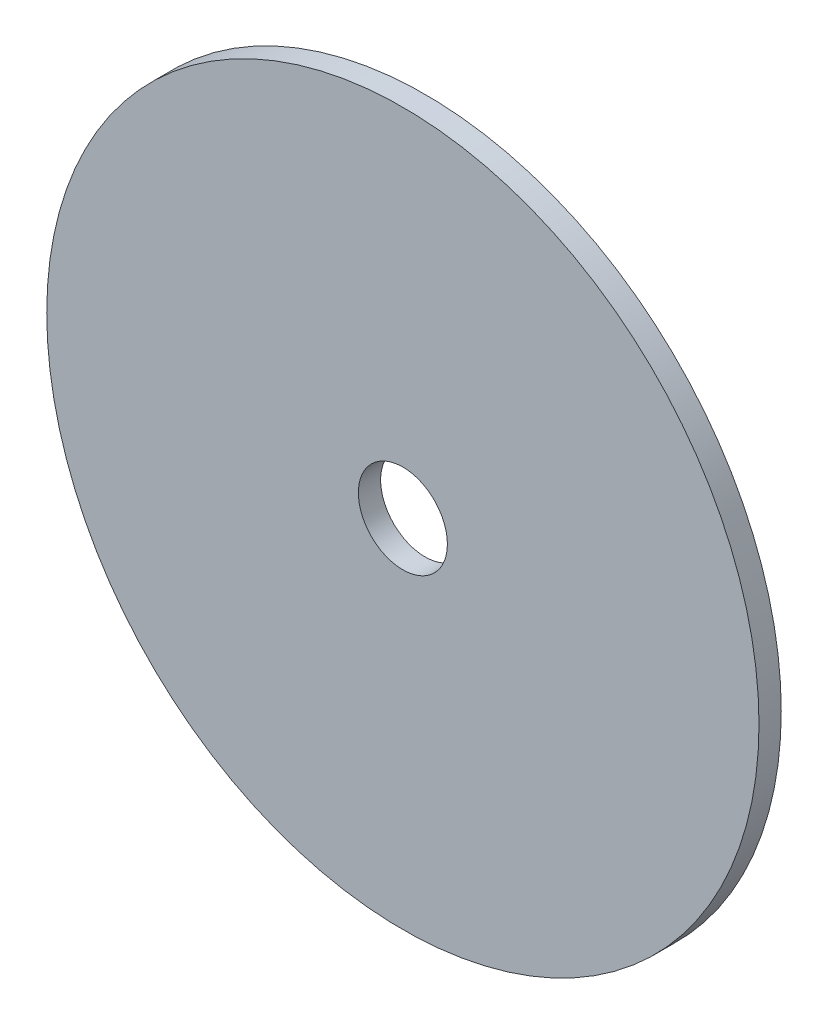
ISO-10303-21;
HEADER;
FILE_DESCRIPTION(('STEP AP214'),'2;1');
FILE_NAME('part.step','',(''),(''),'','','');
FILE_SCHEMA(('AUTOMOTIVE_DESIGN { 1 0 10303 214 1 1 1 1 }'));
ENDSEC;
DATA;
#1=APPLICATION_CONTEXT('core data for automotive mechanical design processes');
#2=APPLICATION_PROTOCOL_DEFINITION('international standard','automotive_design',2000,#1);
#3=PRODUCT_CONTEXT('',#1,'mechanical');
#4=PRODUCT('Part','Part','',(#3));
#5=PRODUCT_RELATED_PRODUCT_CATEGORY('part','',(#4));
#6=PRODUCT_DEFINITION_FORMATION('','',#4);
#7=PRODUCT_DEFINITION_CONTEXT('part definition',#1,'design');
#8=PRODUCT_DEFINITION('design','',#6,#7);
#9=PRODUCT_DEFINITION_SHAPE('','',#8);
#10=(LENGTH_UNIT() NAMED_UNIT(*) SI_UNIT(.MILLI.,.METRE.));
#11=(NAMED_UNIT(*) PLANE_ANGLE_UNIT() SI_UNIT($,.RADIAN.));
#12=(NAMED_UNIT(*) SI_UNIT($,.STERADIAN.) SOLID_ANGLE_UNIT());
#13=UNCERTAINTY_MEASURE_WITH_UNIT(LENGTH_MEASURE(1.E-05),#10,'distance_accuracy_value','');
#14=(GEOMETRIC_REPRESENTATION_CONTEXT(3) GLOBAL_UNCERTAINTY_ASSIGNED_CONTEXT((#13)) GLOBAL_UNIT_ASSIGNED_CONTEXT((#10,
#11,#12)) REPRESENTATION_CONTEXT('',''));
#15=CARTESIAN_POINT('',(0.,0.,0.));
#16=DIRECTION('',(0.,0.,1.));
#17=DIRECTION('',(1.,0.,0.));
#18=AXIS2_PLACEMENT_3D('',#15,#16,#17);
#19=CARTESIAN_POINT('',(0.,0.,3.175));
#20=DIRECTION('',(0.,0.,1.));
#21=DIRECTION('',(1.,0.,0.));
#22=AXIS2_PLACEMENT_3D('',#19,#20,#21);
#23=PLANE('',#22);
#24=CARTESIAN_POINT('',(0.,0.,3.175));
#25=DIRECTION('',(0.,0.,1.));
#26=DIRECTION('',(1.,0.,0.));
#27=AXIS2_PLACEMENT_3D('',#24,#25,#26);
#28=CIRCLE('',#27,6.35);
#29=CARTESIAN_POINT('',(6.35,0.,3.175));
#30=VERTEX_POINT('',#29);
#31=EDGE_CURVE('E27',#30,#30,#28,.F.);
#32=ORIENTED_EDGE('',*,*,#31,.T.);
#33=EDGE_LOOP('',(#32));
#34=FACE_BOUND('',#33,.T.);
#35=CARTESIAN_POINT('',(0.,0.,3.175));
#36=DIRECTION('',(0.,0.,1.));
#37=DIRECTION('',(1.,0.,0.));
#38=AXIS2_PLACEMENT_3D('',#35,#36,#37);
#39=CIRCLE('',#38,50.8);
#40=CARTESIAN_POINT('',(50.8,0.,3.175));
#41=VERTEX_POINT('',#40);
#42=EDGE_CURVE('E18',#41,#41,#39,.F.);
#43=ORIENTED_EDGE('',*,*,#42,.F.);
#44=EDGE_LOOP('',(#43));
#45=FACE_BOUND('',#44,.T.);
#46=ADVANCED_FACE('F15',(#34,#45),#23,.T.);
#47=CARTESIAN_POINT('',(0.,0.,1.5875));
#48=DIRECTION('',(0.,0.,1.));
#49=DIRECTION('',(1.,0.,0.));
#50=AXIS2_PLACEMENT_3D('',#47,#48,#49);
#51=CYLINDRICAL_SURFACE('',#50,50.8);
#52=CARTESIAN_POINT('',(0.,0.,0.));
#53=DIRECTION('',(0.,0.,1.));
#54=DIRECTION('',(1.,0.,0.));
#55=AXIS2_PLACEMENT_3D('',#52,#53,#54);
#56=CIRCLE('',#55,50.8);
#57=CARTESIAN_POINT('',(50.8,0.,0.));
#58=VERTEX_POINT('',#57);
#59=EDGE_CURVE('E22',#58,#58,#56,.T.);
#60=ORIENTED_EDGE('',*,*,#59,.T.);
#61=EDGE_LOOP('',(#60));
#62=FACE_BOUND('',#61,.T.);
#63=ORIENTED_EDGE('',*,*,#42,.T.);
#64=EDGE_LOOP('',(#63));
#65=FACE_BOUND('',#64,.T.);
#66=ADVANCED_FACE('F35',(#62,#65),#51,.T.);
#67=CARTESIAN_POINT('',(0.,0.,1.5875));
#68=DIRECTION('',(0.,0.,1.));
#69=DIRECTION('',(1.,0.,0.));
#70=AXIS2_PLACEMENT_3D('',#67,#68,#69);
#71=CYLINDRICAL_SURFACE('',#70,6.35);
#72=CARTESIAN_POINT('',(0.,0.,0.));
#73=DIRECTION('',(0.,0.,1.));
#74=DIRECTION('',(1.,0.,0.));
#75=AXIS2_PLACEMENT_3D('',#72,#73,#74);
#76=CIRCLE('',#75,6.35);
#77=CARTESIAN_POINT('',(6.35,0.,0.));
#78=VERTEX_POINT('',#77);
#79=EDGE_CURVE('E10',#78,#78,#76,.F.);
#80=ORIENTED_EDGE('',*,*,#79,.T.);
#81=EDGE_LOOP('',(#80));
#82=FACE_BOUND('',#81,.T.);
#83=ORIENTED_EDGE('',*,*,#31,.F.);
#84=EDGE_LOOP('',(#83));
#85=FACE_BOUND('',#84,.T.);
#86=ADVANCED_FACE('F42',(#82,#85),#71,.F.);
#87=CARTESIAN_POINT('',(0.,0.,0.));
#88=DIRECTION('',(0.,0.,1.));
#89=DIRECTION('',(1.,0.,0.));
#90=AXIS2_PLACEMENT_3D('',#87,#88,#89);
#91=PLANE('',#90);
#92=ORIENTED_EDGE('',*,*,#79,.F.);
#93=EDGE_LOOP('',(#92));
#94=FACE_BOUND('',#93,.T.);
#95=ORIENTED_EDGE('',*,*,#59,.F.);
#96=EDGE_LOOP('',(#95));
#97=FACE_BOUND('',#96,.T.);
#98=ADVANCED_FACE('F44',(#94,#97),#91,.F.);
#99=CLOSED_SHELL('',(#46,#66,#86,#98));
#100=MANIFOLD_SOLID_BREP('B1',#99);
#101=ADVANCED_BREP_SHAPE_REPRESENTATION('',(#18,#100),#14);
#102=SHAPE_DEFINITION_REPRESENTATION(#9,#101);
ENDSEC;
END-ISO-10303-21;
